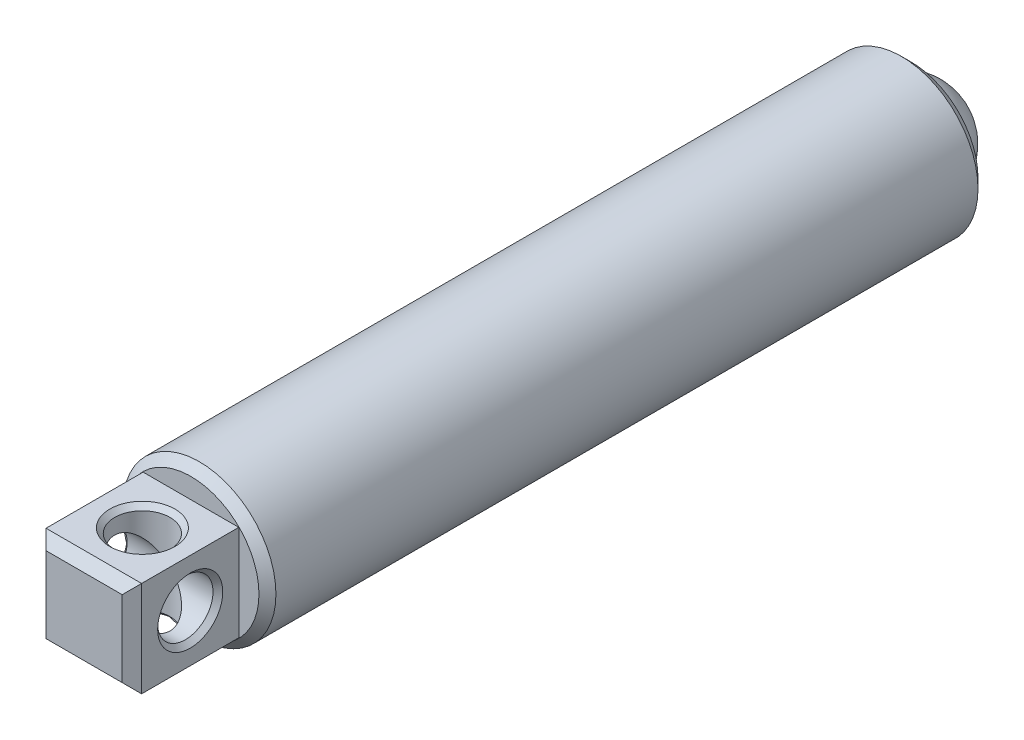
ISO-10303-21;
HEADER;
FILE_DESCRIPTION(('STEP AP214'),'2;1');
FILE_NAME('part.step','',(''),(''),'','','');
FILE_SCHEMA(('AUTOMOTIVE_DESIGN { 1 0 10303 214 1 1 1 1 }'));
ENDSEC;
DATA;
#1=APPLICATION_CONTEXT('core data for automotive mechanical design processes');
#2=APPLICATION_PROTOCOL_DEFINITION('international standard','automotive_design',2000,#1);
#3=PRODUCT_CONTEXT('',#1,'mechanical');
#4=PRODUCT('Part','Part','',(#3));
#5=PRODUCT_RELATED_PRODUCT_CATEGORY('part','',(#4));
#6=PRODUCT_DEFINITION_FORMATION('','',#4);
#7=PRODUCT_DEFINITION_CONTEXT('part definition',#1,'design');
#8=PRODUCT_DEFINITION('design','',#6,#7);
#9=PRODUCT_DEFINITION_SHAPE('','',#8);
#10=(LENGTH_UNIT() NAMED_UNIT(*) SI_UNIT(.MILLI.,.METRE.));
#11=(NAMED_UNIT(*) PLANE_ANGLE_UNIT() SI_UNIT($,.RADIAN.));
#12=(NAMED_UNIT(*) SI_UNIT($,.STERADIAN.) SOLID_ANGLE_UNIT());
#13=UNCERTAINTY_MEASURE_WITH_UNIT(LENGTH_MEASURE(1.E-05),#10,'distance_accuracy_value','');
#14=(GEOMETRIC_REPRESENTATION_CONTEXT(3) GLOBAL_UNCERTAINTY_ASSIGNED_CONTEXT((#13)) GLOBAL_UNIT_ASSIGNED_CONTEXT((#10,
#11,#12)) REPRESENTATION_CONTEXT('',''));
#15=CARTESIAN_POINT('',(0.,0.,0.));
#16=DIRECTION('',(0.,0.,1.));
#17=DIRECTION('',(1.,0.,0.));
#18=AXIS2_PLACEMENT_3D('',#15,#16,#17);
#19=CARTESIAN_POINT('',(1.6625129625254,-2.46036743646982,-11.2258856071015));
#20=DIRECTION('',(0.0471626503272194,0.998887223070809,0.));
#21=DIRECTION('',(-0.998887223070809,0.0471626503272194,0.));
#22=AXIS2_PLACEMENT_3D('',#19,#20,#21);
#23=SPHERICAL_SURFACE('',#22,1.3890625);
#24=CARTESIAN_POINT('',(1.6625129625254,-2.46036743646982,-11.2258856071015));
#25=DIRECTION('',(-0.0471626503272197,-0.998887223070809,0.));
#26=DIRECTION('',(0.,0.,-1.));
#27=AXIS2_PLACEMENT_3D('',#24,#25,#26);
#28=CIRCLE('',#27,1.3890625);
#29=CARTESIAN_POINT('',(0.274996179228602,-2.39485556749967,-11.2258856071015));
#30=VERTEX_POINT('',#29);
#31=CARTESIAN_POINT('',(3.05002974582219,-2.52587930543998,-11.2258856071015));
#32=VERTEX_POINT('',#31);
#33=EDGE_CURVE('P0_E38',#30,#32,#28,.T.);
#34=ORIENTED_EDGE('',*,*,#33,.T.);
#35=CARTESIAN_POINT('',(1.6625129625254,-2.46036743646982,-11.2258856071015));
#36=DIRECTION('',(0.,0.,-1.));
#37=DIRECTION('',(-0.998887223070809,0.0471626503272197,0.));
#38=AXIS2_PLACEMENT_3D('',#35,#36,#37);
#39=CIRCLE('',#38,1.3890625);
#40=EDGE_CURVE('P0_E11',#32,#30,#39,.T.);
#41=ORIENTED_EDGE('',*,*,#40,.T.);
#42=EDGE_LOOP('',(#34,#41));
#43=FACE_BOUND('',#42,.T.);
#44=ADVANCED_FACE('P0_F16',(#43),#23,.T.);
#45=ORIENTED_EDGE('',*,*,#33,.F.);
#46=CARTESIAN_POINT('',(1.6625129625254,-2.46036743646982,-11.2258856071015));
#47=DIRECTION('',(0.,0.,-1.));
#48=DIRECTION('',(-0.998887223070809,0.0471626503272197,0.));
#49=AXIS2_PLACEMENT_3D('',#46,#47,#48);
#50=CIRCLE('',#49,1.3890625);
#51=EDGE_CURVE('P0_E23',#30,#32,#50,.T.);
#52=ORIENTED_EDGE('',*,*,#51,.T.);
#53=EDGE_LOOP('',(#45,#52));
#54=FACE_BOUND('',#53,.T.);
#55=ADVANCED_FACE('P0_F37',(#54),#23,.T.);
#56=ORIENTED_EDGE('',*,*,#40,.F.);
#57=EDGE_CURVE('P0_E34',#32,#30,#28,.T.);
#58=ORIENTED_EDGE('',*,*,#57,.T.);
#59=EDGE_LOOP('',(#56,#58));
#60=FACE_BOUND('',#59,.T.);
#61=ADVANCED_FACE('P0_F32',(#60),#23,.T.);
#62=ORIENTED_EDGE('',*,*,#51,.F.);
#63=ORIENTED_EDGE('',*,*,#57,.F.);
#64=EDGE_LOOP('',(#62,#63));
#65=FACE_BOUND('',#64,.T.);
#66=ADVANCED_FACE('P0_F18',(#65),#23,.T.);
#67=CLOSED_SHELL('',(#44,#55,#61,#66));
#68=MANIFOLD_SOLID_BREP('P0_B1',#67);
#69=CARTESIAN_POINT('',(-0.337483037474602,-2.46036743646982,8.6550518928985));
#70=DIRECTION('',(1.,0.,0.));
#71=DIRECTION('',(0.,0.,-1.));
#72=AXIS2_PLACEMENT_3D('',#69,#70,#71);
#73=CYLINDRICAL_SURFACE('',#72,0.7239);
#74=CARTESIAN_POINT('',(2.78551296252539,-2.46036743646982,8.6550518928985));
#75=DIRECTION('',(-1.,0.,0.));
#76=DIRECTION('',(0.,0.,1.));
#77=AXIS2_PLACEMENT_3D('',#74,#75,#76);
#78=CIRCLE('',#77,0.7239);
#79=CARTESIAN_POINT('',(2.78551296252539,-2.46036743646982,9.3789518928985));
#80=VERTEX_POINT('',#79);
#81=EDGE_CURVE('P1_E119',#80,#80,#78,.F.);
#82=ORIENTED_EDGE('',*,*,#81,.T.);
#83=EDGE_LOOP('',(#82));
#84=FACE_BOUND('',#83,.T.);
#85=CARTESIAN_POINT('',(1.6625129625254,-2.46036743646982,8.6550518928985));
#86=DIRECTION('',(0.707106781186547,-0.707106781186547,0.));
#87=DIRECTION('',(0.707106781186547,0.707106781186547,0.));
#88=AXIS2_PLACEMENT_3D('',#85,#86,#87);
#89=ELLIPSE('',#88,1.02374919780188,0.7239);
#90=CARTESIAN_POINT('',(1.6625129625254,-2.46036743646982,9.3789518928985));
#91=VERTEX_POINT('',#90);
#92=CARTESIAN_POINT('',(1.6625129625254,-2.46036743646982,7.9311518928985));
#93=VERTEX_POINT('',#92);
#94=EDGE_CURVE('P1_E86',#91,#93,#89,.F.);
#95=ORIENTED_EDGE('',*,*,#94,.T.);
#96=CARTESIAN_POINT('',(1.6625129625254,-2.46036743646982,8.6550518928985));
#97=DIRECTION('',(0.707106781186547,0.707106781186547,0.));
#98=DIRECTION('',(0.707106781186547,-0.707106781186547,0.));
#99=AXIS2_PLACEMENT_3D('',#96,#97,#98);
#100=ELLIPSE('',#99,1.02374919780188,0.7239);
#101=EDGE_CURVE('P1_E82',#93,#91,#100,.F.);
#102=ORIENTED_EDGE('',*,*,#101,.T.);
#103=EDGE_LOOP('',(#95,#102));
#104=FACE_BOUND('',#103,.T.);
#105=ADVANCED_FACE('P1_F15',(#84,#104),#73,.F.);
#106=CARTESIAN_POINT('',(1.6625129625254,-0.682367436469824,7.3850518928985));
#107=DIRECTION('',(0.,0.,-1.));
#108=DIRECTION('',(-1.,0.,0.));
#109=AXIS2_PLACEMENT_3D('',#106,#107,#108);
#110=PLANE('',#109);
#111=CARTESIAN_POINT('',(1.6625129625254,-2.46036743646982,7.3850518928985));
#112=DIRECTION('',(0.,0.,1.));
#113=DIRECTION('',(1.,0.,0.));
#114=AXIS2_PLACEMENT_3D('',#111,#112,#113);
#115=CIRCLE('',#114,1.778);
#116=CARTESIAN_POINT('',(3.4405129625254,-2.46036743646982,7.3850518928985));
#117=VERTEX_POINT('',#116);
#118=EDGE_CURVE('P1_E178',#117,#117,#115,.T.);
#119=ORIENTED_EDGE('',*,*,#118,.T.);
#120=EDGE_LOOP('',(#119));
#121=FACE_BOUND('',#120,.T.);
#122=DIRECTION('',(0.,1.,0.));
#123=VECTOR('',#122,1.);
#124=CARTESIAN_POINT('',(2.9125129625254,-3.71036743646982,7.3850518928985));
#125=LINE('',#124,#123);
#126=CARTESIAN_POINT('',(2.9125129625254,-3.71036743646982,7.3850518928985));
#127=VERTEX_POINT('',#126);
#128=CARTESIAN_POINT('',(2.9125129625254,-1.21036743646982,7.3850518928985));
#129=VERTEX_POINT('',#128);
#130=EDGE_CURVE('P1_E152',#127,#129,#125,.T.);
#131=ORIENTED_EDGE('',*,*,#130,.F.);
#132=DIRECTION('',(1.,0.,0.));
#133=VECTOR('',#132,1.);
#134=CARTESIAN_POINT('',(0.412512962525397,-3.71036743646982,7.3850518928985));
#135=LINE('',#134,#133);
#136=CARTESIAN_POINT('',(0.412512962525397,-3.71036743646982,7.3850518928985));
#137=VERTEX_POINT('',#136);
#138=EDGE_CURVE('P1_E167',#137,#127,#135,.T.);
#139=ORIENTED_EDGE('',*,*,#138,.F.);
#140=DIRECTION('',(0.,-1.,0.));
#141=VECTOR('',#140,1.);
#142=CARTESIAN_POINT('',(0.412512962525397,-3.71036743646982,7.3850518928985));
#143=LINE('',#142,#141);
#144=CARTESIAN_POINT('',(0.412512962525397,-1.21036743646982,7.3850518928985));
#145=VERTEX_POINT('',#144);
#146=EDGE_CURVE('P1_E162',#145,#137,#143,.T.);
#147=ORIENTED_EDGE('',*,*,#146,.F.);
#148=DIRECTION('',(-1.,0.,0.));
#149=VECTOR('',#148,1.);
#150=CARTESIAN_POINT('',(0.412512962525397,-1.21036743646982,7.3850518928985));
#151=LINE('',#150,#149);
#152=EDGE_CURVE('P1_E157',#129,#145,#151,.T.);
#153=ORIENTED_EDGE('',*,*,#152,.F.);
#154=EDGE_LOOP('',(#131,#139,#147,#153));
#155=FACE_BOUND('',#154,.T.);
#156=ADVANCED_FACE('P1_F195',(#121,#155),#110,.F.);
#157=CARTESIAN_POINT('',(1.6625129625254,-2.46036743646982,-9.26145458061761));
#158=DIRECTION('',(0.,0.,-1.));
#159=DIRECTION('',(-1.,0.,0.));
#160=AXIS2_PLACEMENT_3D('',#157,#158,#159);
#161=CONICAL_SURFACE('',#160,0.,0.785398163397443);
#162=CARTESIAN_POINT('',(1.6625129625254,-2.46036743646982,-10.6584545806176));
#163=DIRECTION('',(0.,0.,1.));
#164=DIRECTION('',(1.,0.,0.));
#165=AXIS2_PLACEMENT_3D('',#162,#163,#164);
#166=CIRCLE('',#165,1.397);
#167=CARTESIAN_POINT('',(3.0595129625254,-2.46036743646982,-10.6584545806176));
#168=VERTEX_POINT('',#167);
#169=EDGE_CURVE('P1_E92',#168,#168,#166,.T.);
#170=ORIENTED_EDGE('',*,*,#169,.F.);
#171=EDGE_LOOP('',(#170));
#172=FACE_BOUND('',#171,.T.);
#173=CARTESIAN_POINT('',(1.6625129625254,-2.46036743646982,-9.26145458061761));
#174=VERTEX_POINT('',#173);
#175=VERTEX_LOOP('',#174);
#176=FACE_BOUND('',#175,.T.);
#177=ADVANCED_FACE('P1_F192',(#172,#176),#161,.F.);
#178=CARTESIAN_POINT('',(1.6625129625254,-2.46036743646982,7.3850518928985));
#179=DIRECTION('',(0.,0.,1.));
#180=DIRECTION('',(1.,0.,0.));
#181=AXIS2_PLACEMENT_3D('',#178,#179,#180);
#182=CYLINDRICAL_SURFACE('',#181,1.397);
#183=CARTESIAN_POINT('',(1.6625129625254,-2.46036743646982,-11.4465481071015));
#184=DIRECTION('',(0.,0.,1.));
#185=DIRECTION('',(1.,0.,0.));
#186=AXIS2_PLACEMENT_3D('',#183,#184,#185);
#187=CIRCLE('',#186,1.397);
#188=CARTESIAN_POINT('',(3.0595129625254,-2.46036743646982,-11.4465481071015));
#189=VERTEX_POINT('',#188);
#190=EDGE_CURVE('P1_E184',#189,#189,#187,.T.);
#191=ORIENTED_EDGE('',*,*,#190,.F.);
#192=EDGE_LOOP('',(#191));
#193=FACE_BOUND('',#192,.T.);
#194=ORIENTED_EDGE('',*,*,#169,.T.);
#195=EDGE_LOOP('',(#194));
#196=FACE_BOUND('',#195,.T.);
#197=ADVANCED_FACE('P1_F190',(#193,#196),#182,.F.);
#198=CARTESIAN_POINT('',(1.6625129625254,-0.460371436469824,-11.4465481071015));
#199=DIRECTION('',(0.,0.,1.));
#200=DIRECTION('',(1.,0.,0.));
#201=AXIS2_PLACEMENT_3D('',#198,#199,#200);
#202=PLANE('',#201);
#203=CARTESIAN_POINT('',(1.6625129625254,-2.46036743646982,-11.4465481071015));
#204=DIRECTION('',(0.,0.,1.));
#205=DIRECTION('',(1.,0.,0.));
#206=AXIS2_PLACEMENT_3D('',#203,#204,#205);
#207=CIRCLE('',#206,1.745996);
#208=CARTESIAN_POINT('',(3.4085089625254,-2.46036743646982,-11.4465481071015));
#209=VERTEX_POINT('',#208);
#210=EDGE_CURVE('P1_E101',#209,#209,#207,.F.);
#211=ORIENTED_EDGE('',*,*,#210,.T.);
#212=EDGE_LOOP('',(#211));
#213=FACE_BOUND('',#212,.T.);
#214=ORIENTED_EDGE('',*,*,#190,.T.);
#215=EDGE_LOOP('',(#214));
#216=FACE_BOUND('',#215,.T.);
#217=ADVANCED_FACE('P1_F202',(#213,#216),#202,.F.);
#218=CARTESIAN_POINT('',(1.6625129625254,-2.46036743646982,7.3850518928985));
#219=DIRECTION('',(0.,0.,1.));
#220=DIRECTION('',(1.,0.,0.));
#221=AXIS2_PLACEMENT_3D('',#218,#219,#220);
#222=CYLINDRICAL_SURFACE('',#221,1.999996);
#223=CARTESIAN_POINT('',(1.6625129625254,-2.46036743646982,-11.1925481071015));
#224=DIRECTION('',(0.,0.,1.));
#225=DIRECTION('',(1.,0.,0.));
#226=AXIS2_PLACEMENT_3D('',#223,#224,#225);
#227=CIRCLE('',#226,1.999996);
#228=CARTESIAN_POINT('',(3.6625089625254,-2.46036743646982,-11.1925481071015));
#229=VERTEX_POINT('',#228);
#230=EDGE_CURVE('P1_E94',#229,#229,#227,.T.);
#231=ORIENTED_EDGE('',*,*,#230,.T.);
#232=EDGE_LOOP('',(#231));
#233=FACE_BOUND('',#232,.T.);
#234=CARTESIAN_POINT('',(1.6625129625254,-2.46036743646982,7.1630558928985));
#235=DIRECTION('',(0.,0.,1.));
#236=DIRECTION('',(1.,0.,0.));
#237=AXIS2_PLACEMENT_3D('',#234,#235,#236);
#238=CIRCLE('',#237,1.999996);
#239=CARTESIAN_POINT('',(3.6625089625254,-2.46036743646982,7.1630558928985));
#240=VERTEX_POINT('',#239);
#241=EDGE_CURVE('P1_E181',#240,#240,#238,.T.);
#242=ORIENTED_EDGE('',*,*,#241,.F.);
#243=EDGE_LOOP('',(#242));
#244=FACE_BOUND('',#243,.T.);
#245=ADVANCED_FACE('P1_F285',(#233,#244),#222,.T.);
#246=CARTESIAN_POINT('',(1.6625129625254,-2.46036743646982,7.1630558928985));
#247=DIRECTION('',(0.,0.,-1.));
#248=DIRECTION('',(-1.,0.,0.));
#249=AXIS2_PLACEMENT_3D('',#246,#247,#248);
#250=CONICAL_SURFACE('',#249,1.999996,0.78539816339745);
#251=ORIENTED_EDGE('',*,*,#118,.F.);
#252=EDGE_LOOP('',(#251));
#253=FACE_BOUND('',#252,.T.);
#254=ORIENTED_EDGE('',*,*,#241,.T.);
#255=EDGE_LOOP('',(#254));
#256=FACE_BOUND('',#255,.T.);
#257=ADVANCED_FACE('P1_F288',(#253,#256),#250,.T.);
#258=CARTESIAN_POINT('',(2.9125129625254,-3.71036743646982,10.1790518928985));
#259=DIRECTION('',(-1.,0.,0.));
#260=DIRECTION('',(0.,0.,1.));
#261=AXIS2_PLACEMENT_3D('',#258,#259,#260);
#262=PLANE('',#261);
#263=CARTESIAN_POINT('',(2.9125129625254,-2.46036743646982,8.6550518928985));
#264=DIRECTION('',(-1.,0.,0.));
#265=DIRECTION('',(0.,0.,1.));
#266=AXIS2_PLACEMENT_3D('',#263,#264,#265);
#267=CIRCLE('',#266,0.850900000000005);
#268=CARTESIAN_POINT('',(2.9125129625254,-2.46036743646982,9.5059518928985));
#269=VERTEX_POINT('',#268);
#270=EDGE_CURVE('P1_E116',#269,#269,#267,.T.);
#271=ORIENTED_EDGE('',*,*,#270,.T.);
#272=EDGE_LOOP('',(#271));
#273=FACE_BOUND('',#272,.T.);
#274=DIRECTION('',(0.,0.,-1.));
#275=VECTOR('',#274,1.);
#276=CARTESIAN_POINT('',(2.9125129625254,-1.21036743646982,10.1790518928985));
#277=LINE('',#276,#275);
#278=CARTESIAN_POINT('',(2.9125129625254,-1.21036743646982,9.9250518928985));
#279=VERTEX_POINT('',#278);
#280=EDGE_CURVE('P1_E176',#279,#129,#277,.T.);
#281=ORIENTED_EDGE('',*,*,#280,.F.);
#282=DIRECTION('',(0.,-1.,0.));
#283=VECTOR('',#282,1.);
#284=CARTESIAN_POINT('',(2.9125129625254,-3.71036743646982,9.9250518928985));
#285=LINE('',#284,#283);
#286=CARTESIAN_POINT('',(2.9125129625254,-3.71036743646982,9.9250518928985));
#287=VERTEX_POINT('',#286);
#288=EDGE_CURVE('P1_E10',#279,#287,#285,.T.);
#289=ORIENTED_EDGE('',*,*,#288,.T.);
#290=DIRECTION('',(0.,0.,-1.));
#291=VECTOR('',#290,1.);
#292=CARTESIAN_POINT('',(2.9125129625254,-3.71036743646982,10.1790518928985));
#293=LINE('',#292,#291);
#294=EDGE_CURVE('P1_E170',#287,#127,#293,.T.);
#295=ORIENTED_EDGE('',*,*,#294,.T.);
#296=ORIENTED_EDGE('',*,*,#130,.T.);
#297=EDGE_LOOP('',(#281,#289,#295,#296));
#298=FACE_BOUND('',#297,.T.);
#299=ADVANCED_FACE('P1_F245',(#273,#298),#262,.F.);
#300=CARTESIAN_POINT('',(0.412512962525397,-1.21036743646982,10.1790518928985));
#301=DIRECTION('',(0.,-1.,0.));
#302=DIRECTION('',(0.,0.,-1.));
#303=AXIS2_PLACEMENT_3D('',#300,#301,#302);
#304=PLANE('',#303);
#305=CARTESIAN_POINT('',(1.6625129625254,-1.21036743646982,8.6550518928985));
#306=DIRECTION('',(0.,-1.,0.));
#307=DIRECTION('',(0.,0.,-1.));
#308=AXIS2_PLACEMENT_3D('',#305,#306,#307);
#309=CIRCLE('',#308,0.850900000000005);
#310=CARTESIAN_POINT('',(1.6625129625254,-1.21036743646982,7.8041518928985));
#311=VERTEX_POINT('',#310);
#312=EDGE_CURVE('P1_E122',#311,#311,#309,.T.);
#313=ORIENTED_EDGE('',*,*,#312,.T.);
#314=EDGE_LOOP('',(#313));
#315=FACE_BOUND('',#314,.T.);
#316=DIRECTION('',(0.,0.,-1.));
#317=VECTOR('',#316,1.);
#318=CARTESIAN_POINT('',(0.412512962525397,-1.21036743646982,10.1790518928985));
#319=LINE('',#318,#317);
#320=CARTESIAN_POINT('',(0.412512962525397,-1.21036743646982,9.9250518928985));
#321=VERTEX_POINT('',#320);
#322=EDGE_CURVE('P1_E174',#321,#145,#319,.T.);
#323=ORIENTED_EDGE('',*,*,#322,.F.);
#324=DIRECTION('',(1.,0.,0.));
#325=VECTOR('',#324,1.);
#326=CARTESIAN_POINT('',(0.412512962525397,-1.21036743646982,9.9250518928985));
#327=LINE('',#326,#325);
#328=EDGE_CURVE('P1_E24',#321,#279,#327,.T.);
#329=ORIENTED_EDGE('',*,*,#328,.T.);
#330=ORIENTED_EDGE('',*,*,#280,.T.);
#331=ORIENTED_EDGE('',*,*,#152,.T.);
#332=EDGE_LOOP('',(#323,#329,#330,#331));
#333=FACE_BOUND('',#332,.T.);
#334=ADVANCED_FACE('P1_F236',(#315,#333),#304,.F.);
#335=CARTESIAN_POINT('',(0.412512962525397,-3.71036743646982,10.1790518928985));
#336=DIRECTION('',(1.,0.,0.));
#337=DIRECTION('',(0.,0.,-1.));
#338=AXIS2_PLACEMENT_3D('',#335,#336,#337);
#339=PLANE('',#338);
#340=CARTESIAN_POINT('',(0.412512962525397,-2.46036743646982,8.6550518928985));
#341=DIRECTION('',(1.,0.,0.));
#342=DIRECTION('',(0.,0.,-1.));
#343=AXIS2_PLACEMENT_3D('',#340,#341,#342);
#344=CIRCLE('',#343,0.8509);
#345=CARTESIAN_POINT('',(0.412512962525397,-2.46036743646982,7.8041518928985));
#346=VERTEX_POINT('',#345);
#347=EDGE_CURVE('P1_E104',#346,#346,#344,.T.);
#348=ORIENTED_EDGE('',*,*,#347,.T.);
#349=EDGE_LOOP('',(#348));
#350=FACE_BOUND('',#349,.T.);
#351=DIRECTION('',(0.,0.,-1.));
#352=VECTOR('',#351,1.);
#353=CARTESIAN_POINT('',(0.412512962525397,-3.71036743646982,10.1790518928985));
#354=LINE('',#353,#352);
#355=CARTESIAN_POINT('',(0.412512962525397,-3.71036743646982,9.9250518928985));
#356=VERTEX_POINT('',#355);
#357=EDGE_CURVE('P1_E172',#356,#137,#354,.T.);
#358=ORIENTED_EDGE('',*,*,#357,.F.);
#359=DIRECTION('',(0.,1.,0.));
#360=VECTOR('',#359,1.);
#361=CARTESIAN_POINT('',(0.412512962525397,-3.71036743646982,9.9250518928985));
#362=LINE('',#361,#360);
#363=EDGE_CURVE('P1_E39',#356,#321,#362,.T.);
#364=ORIENTED_EDGE('',*,*,#363,.T.);
#365=ORIENTED_EDGE('',*,*,#322,.T.);
#366=ORIENTED_EDGE('',*,*,#146,.T.);
#367=EDGE_LOOP('',(#358,#364,#365,#366));
#368=FACE_BOUND('',#367,.T.);
#369=ADVANCED_FACE('P1_F234',(#350,#368),#339,.F.);
#370=CARTESIAN_POINT('',(0.412512962525397,-3.71036743646982,10.1790518928985));
#371=DIRECTION('',(0.,1.,0.));
#372=DIRECTION('',(0.,0.,1.));
#373=AXIS2_PLACEMENT_3D('',#370,#371,#372);
#374=PLANE('',#373);
#375=CARTESIAN_POINT('',(1.6625129625254,-3.71036743646982,8.6550518928985));
#376=DIRECTION('',(0.,1.,0.));
#377=DIRECTION('',(0.,0.,1.));
#378=AXIS2_PLACEMENT_3D('',#375,#376,#377);
#379=CIRCLE('',#378,0.8509);
#380=CARTESIAN_POINT('',(1.6625129625254,-3.71036743646982,9.5059518928985));
#381=VERTEX_POINT('',#380);
#382=EDGE_CURVE('P1_E110',#381,#381,#379,.T.);
#383=ORIENTED_EDGE('',*,*,#382,.T.);
#384=EDGE_LOOP('',(#383));
#385=FACE_BOUND('',#384,.T.);
#386=ORIENTED_EDGE('',*,*,#294,.F.);
#387=DIRECTION('',(-1.,0.,0.));
#388=VECTOR('',#387,1.);
#389=CARTESIAN_POINT('',(0.412512962525397,-3.71036743646982,9.9250518928985));
#390=LINE('',#389,#388);
#391=EDGE_CURVE('P1_E137',#287,#356,#390,.T.);
#392=ORIENTED_EDGE('',*,*,#391,.T.);
#393=ORIENTED_EDGE('',*,*,#357,.T.);
#394=ORIENTED_EDGE('',*,*,#138,.T.);
#395=EDGE_LOOP('',(#386,#392,#393,#394));
#396=FACE_BOUND('',#395,.T.);
#397=ADVANCED_FACE('P1_F222',(#385,#396),#374,.F.);
#398=CARTESIAN_POINT('',(1.6625129625254,-2.46036743646982,10.1790518928985));
#399=DIRECTION('',(0.,0.,-1.));
#400=DIRECTION('',(-1.,0.,0.));
#401=AXIS2_PLACEMENT_3D('',#398,#399,#400);
#402=PLANE('',#401);
#403=DIRECTION('',(0.,-1.,0.));
#404=VECTOR('',#403,1.);
#405=CARTESIAN_POINT('',(0.666512962525401,-2.46036743646982,10.1790518928985));
#406=LINE('',#405,#404);
#407=CARTESIAN_POINT('',(0.666512962525401,-1.46436743646983,10.1790518928985));
#408=VERTEX_POINT('',#407);
#409=CARTESIAN_POINT('',(0.666512962525401,-3.45636743646982,10.1790518928985));
#410=VERTEX_POINT('',#409);
#411=EDGE_CURVE('P1_E132',#408,#410,#406,.T.);
#412=ORIENTED_EDGE('',*,*,#411,.T.);
#413=DIRECTION('',(1.,0.,0.));
#414=VECTOR('',#413,1.);
#415=CARTESIAN_POINT('',(1.6625129625254,-3.45636743646982,10.1790518928985));
#416=LINE('',#415,#414);
#417=CARTESIAN_POINT('',(2.65851296252539,-3.45636743646982,10.1790518928985));
#418=VERTEX_POINT('',#417);
#419=EDGE_CURVE('P1_E134',#410,#418,#416,.T.);
#420=ORIENTED_EDGE('',*,*,#419,.T.);
#421=DIRECTION('',(0.,1.,0.));
#422=VECTOR('',#421,1.);
#423=CARTESIAN_POINT('',(2.65851296252539,-2.46036743646982,10.1790518928985));
#424=LINE('',#423,#422);
#425=CARTESIAN_POINT('',(2.65851296252539,-1.46436743646983,10.1790518928985));
#426=VERTEX_POINT('',#425);
#427=EDGE_CURVE('P1_E128',#418,#426,#424,.T.);
#428=ORIENTED_EDGE('',*,*,#427,.T.);
#429=DIRECTION('',(-1.,0.,0.));
#430=VECTOR('',#429,1.);
#431=CARTESIAN_POINT('',(1.6625129625254,-1.46436743646983,10.1790518928985));
#432=LINE('',#431,#430);
#433=EDGE_CURVE('P1_E130',#426,#408,#432,.T.);
#434=ORIENTED_EDGE('',*,*,#433,.T.);
#435=EDGE_LOOP('',(#412,#420,#428,#434));
#436=FACE_BOUND('',#435,.T.);
#437=ADVANCED_FACE('P1_F215',(#436),#402,.F.);
#438=CARTESIAN_POINT('',(0.539512962525398,-2.46036743646982,8.6550518928985));
#439=DIRECTION('',(1.,0.,0.));
#440=DIRECTION('',(0.,0.,-1.));
#441=AXIS2_PLACEMENT_3D('',#438,#439,#440);
#442=CIRCLE('',#441,0.7239);
#443=CARTESIAN_POINT('',(0.539512962525398,-2.46036743646982,7.9311518928985));
#444=VERTEX_POINT('',#443);
#445=EDGE_CURVE('P1_E107',#444,#444,#442,.F.);
#446=ORIENTED_EDGE('',*,*,#445,.T.);
#447=EDGE_LOOP('',(#446));
#448=FACE_BOUND('',#447,.T.);
#449=CARTESIAN_POINT('',(1.6625129625254,-2.46036743646982,8.6550518928985));
#450=DIRECTION('',(0.707106781186547,-0.707106781186547,0.));
#451=DIRECTION('',(0.707106781186547,0.707106781186547,0.));
#452=AXIS2_PLACEMENT_3D('',#449,#450,#451);
#453=ELLIPSE('',#452,1.02374919780188,0.7239);
#454=EDGE_CURVE('P1_E78',#91,#93,#453,.T.);
#455=ORIENTED_EDGE('',*,*,#454,.T.);
#456=CARTESIAN_POINT('',(1.6625129625254,-2.46036743646982,8.6550518928985));
#457=DIRECTION('',(0.707106781186547,0.707106781186547,0.));
#458=DIRECTION('',(0.707106781186547,-0.707106781186547,0.));
#459=AXIS2_PLACEMENT_3D('',#456,#457,#458);
#460=ELLIPSE('',#459,1.02374919780188,0.7239);
#461=EDGE_CURVE('P1_E85',#93,#91,#460,.T.);
#462=ORIENTED_EDGE('',*,*,#461,.T.);
#463=EDGE_LOOP('',(#455,#462));
#464=FACE_BOUND('',#463,.T.);
#465=ADVANCED_FACE('P1_F96',(#448,#464),#73,.F.);
#466=CARTESIAN_POINT('',(1.6625129625254,-4.46036343646982,8.6550518928985));
#467=DIRECTION('',(0.,1.,0.));
#468=DIRECTION('',(0.,0.,1.));
#469=AXIS2_PLACEMENT_3D('',#466,#467,#468);
#470=CYLINDRICAL_SURFACE('',#469,0.7239);
#471=CARTESIAN_POINT('',(1.6625129625254,-1.33736743646983,8.6550518928985));
#472=DIRECTION('',(0.,-1.,0.));
#473=DIRECTION('',(0.,0.,-1.));
#474=AXIS2_PLACEMENT_3D('',#471,#472,#473);
#475=CIRCLE('',#474,0.7239);
#476=CARTESIAN_POINT('',(1.6625129625254,-1.33736743646983,7.9311518928985));
#477=VERTEX_POINT('',#476);
#478=EDGE_CURVE('P1_E125',#477,#477,#475,.F.);
#479=ORIENTED_EDGE('',*,*,#478,.T.);
#480=EDGE_LOOP('',(#479));
#481=FACE_BOUND('',#480,.T.);
#482=ORIENTED_EDGE('',*,*,#94,.F.);
#483=ORIENTED_EDGE('',*,*,#461,.F.);
#484=EDGE_LOOP('',(#482,#483));
#485=FACE_BOUND('',#484,.T.);
#486=ADVANCED_FACE('P1_F90',(#481,#485),#470,.F.);
#487=CARTESIAN_POINT('',(1.6625129625254,-3.58336743646982,8.6550518928985));
#488=DIRECTION('',(0.,1.,0.));
#489=DIRECTION('',(0.,0.,1.));
#490=AXIS2_PLACEMENT_3D('',#487,#488,#489);
#491=CIRCLE('',#490,0.7239);
#492=CARTESIAN_POINT('',(1.6625129625254,-3.58336743646982,9.3789518928985));
#493=VERTEX_POINT('',#492);
#494=EDGE_CURVE('P1_E113',#493,#493,#491,.F.);
#495=ORIENTED_EDGE('',*,*,#494,.T.);
#496=EDGE_LOOP('',(#495));
#497=FACE_BOUND('',#496,.T.);
#498=ORIENTED_EDGE('',*,*,#454,.F.);
#499=ORIENTED_EDGE('',*,*,#101,.F.);
#500=EDGE_LOOP('',(#498,#499));
#501=FACE_BOUND('',#500,.T.);
#502=ADVANCED_FACE('P1_F80',(#497,#501),#470,.F.);
#503=CARTESIAN_POINT('',(1.6625129625254,-2.46036743646982,-11.1925481071015));
#504=DIRECTION('',(0.,0.,1.));
#505=DIRECTION('',(1.,0.,0.));
#506=AXIS2_PLACEMENT_3D('',#503,#504,#505);
#507=CONICAL_SURFACE('',#506,1.999996,0.785398163397451);
#508=ORIENTED_EDGE('',*,*,#210,.F.);
#509=EDGE_LOOP('',(#508));
#510=FACE_BOUND('',#509,.T.);
#511=ORIENTED_EDGE('',*,*,#230,.F.);
#512=EDGE_LOOP('',(#511));
#513=FACE_BOUND('',#512,.T.);
#514=ADVANCED_FACE('P1_F230',(#510,#513),#507,.T.);
#515=CARTESIAN_POINT('',(0.412512962525397,-2.46036743646982,8.6550518928985));
#516=DIRECTION('',(-1.,0.,0.));
#517=DIRECTION('',(0.,0.,1.));
#518=AXIS2_PLACEMENT_3D('',#515,#516,#517);
#519=CONICAL_SURFACE('',#518,0.8509,0.785398163397444);
#520=ORIENTED_EDGE('',*,*,#445,.F.);
#521=EDGE_LOOP('',(#520));
#522=FACE_BOUND('',#521,.T.);
#523=ORIENTED_EDGE('',*,*,#347,.F.);
#524=EDGE_LOOP('',(#523));
#525=FACE_BOUND('',#524,.T.);
#526=ADVANCED_FACE('P1_F226',(#522,#525),#519,.F.);
#527=CARTESIAN_POINT('',(1.6625129625254,-3.71036743646982,8.6550518928985));
#528=DIRECTION('',(0.,-1.,0.));
#529=DIRECTION('',(0.,0.,-1.));
#530=AXIS2_PLACEMENT_3D('',#527,#528,#529);
#531=CONICAL_SURFACE('',#530,0.8509,0.785398163397445);
#532=ORIENTED_EDGE('',*,*,#494,.F.);
#533=EDGE_LOOP('',(#532));
#534=FACE_BOUND('',#533,.T.);
#535=ORIENTED_EDGE('',*,*,#382,.F.);
#536=EDGE_LOOP('',(#535));
#537=FACE_BOUND('',#536,.T.);
#538=ADVANCED_FACE('P1_F229',(#534,#537),#531,.F.);
#539=CARTESIAN_POINT('',(2.9125129625254,-2.46036743646982,8.6550518928985));
#540=DIRECTION('',(1.,0.,0.));
#541=DIRECTION('',(0.,0.,-1.));
#542=AXIS2_PLACEMENT_3D('',#539,#540,#541);
#543=CONICAL_SURFACE('',#542,0.850900000000005,0.785398163397444);
#544=ORIENTED_EDGE('',*,*,#81,.F.);
#545=EDGE_LOOP('',(#544));
#546=FACE_BOUND('',#545,.T.);
#547=ORIENTED_EDGE('',*,*,#270,.F.);
#548=EDGE_LOOP('',(#547));
#549=FACE_BOUND('',#548,.T.);
#550=ADVANCED_FACE('P1_F267',(#546,#549),#543,.F.);
#551=CARTESIAN_POINT('',(1.6625129625254,-1.21036743646982,8.6550518928985));
#552=DIRECTION('',(0.,1.,0.));
#553=DIRECTION('',(0.,0.,1.));
#554=AXIS2_PLACEMENT_3D('',#551,#552,#553);
#555=CONICAL_SURFACE('',#554,0.850900000000005,0.785398163397445);
#556=ORIENTED_EDGE('',*,*,#478,.F.);
#557=EDGE_LOOP('',(#556));
#558=FACE_BOUND('',#557,.T.);
#559=ORIENTED_EDGE('',*,*,#312,.F.);
#560=EDGE_LOOP('',(#559));
#561=FACE_BOUND('',#560,.T.);
#562=ADVANCED_FACE('P1_F261',(#558,#561),#555,.F.);
#563=CARTESIAN_POINT('',(1.6625129625254,-1.46436743646983,10.1790518928985));
#564=DIRECTION('',(0.,-0.707106781186547,-0.707106781186547));
#565=DIRECTION('',(-1.,0.,0.));
#566=AXIS2_PLACEMENT_3D('',#563,#564,#565);
#567=PLANE('',#566);
#568=DIRECTION('',(-0.577350269189626,-0.577350269189626,0.577350269189626));
#569=VECTOR('',#568,1.);
#570=CARTESIAN_POINT('',(2.32651296252539,-1.79636743646983,10.5110518928985));
#571=LINE('',#570,#569);
#572=EDGE_CURVE('P1_E145',#279,#426,#571,.T.);
#573=ORIENTED_EDGE('',*,*,#572,.F.);
#574=ORIENTED_EDGE('',*,*,#328,.F.);
#575=DIRECTION('',(0.577350269189626,-0.577350269189626,0.577350269189626));
#576=VECTOR('',#575,1.);
#577=CARTESIAN_POINT('',(0.9985129625254,-1.79636743646983,10.5110518928985));
#578=LINE('',#577,#576);
#579=EDGE_CURVE('P1_E19',#408,#321,#578,.F.);
#580=ORIENTED_EDGE('',*,*,#579,.F.);
#581=ORIENTED_EDGE('',*,*,#433,.F.);
#582=EDGE_LOOP('',(#573,#574,#580,#581));
#583=FACE_BOUND('',#582,.T.);
#584=ADVANCED_FACE('P1_F17',(#583),#567,.F.);
#585=CARTESIAN_POINT('',(0.666512962525401,-2.46036743646982,10.1790518928985));
#586=DIRECTION('',(0.707106781186547,0.,-0.707106781186547));
#587=DIRECTION('',(0.,-1.,0.));
#588=AXIS2_PLACEMENT_3D('',#585,#586,#587);
#589=PLANE('',#588);
#590=ORIENTED_EDGE('',*,*,#579,.T.);
#591=ORIENTED_EDGE('',*,*,#363,.F.);
#592=DIRECTION('',(0.577350269189626,0.577350269189626,0.577350269189626));
#593=VECTOR('',#592,1.);
#594=CARTESIAN_POINT('',(0.9985129625254,-3.12436743646982,10.5110518928985));
#595=LINE('',#594,#593);
#596=EDGE_CURVE('P1_E144',#410,#356,#595,.F.);
#597=ORIENTED_EDGE('',*,*,#596,.F.);
#598=ORIENTED_EDGE('',*,*,#411,.F.);
#599=EDGE_LOOP('',(#590,#591,#597,#598));
#600=FACE_BOUND('',#599,.T.);
#601=ADVANCED_FACE('P1_F254',(#600),#589,.F.);
#602=CARTESIAN_POINT('',(2.65851296252539,-2.46036743646982,10.1790518928985));
#603=DIRECTION('',(-0.707106781186547,0.,-0.707106781186547));
#604=DIRECTION('',(0.,1.,0.));
#605=AXIS2_PLACEMENT_3D('',#602,#603,#604);
#606=PLANE('',#605);
#607=ORIENTED_EDGE('',*,*,#572,.T.);
#608=ORIENTED_EDGE('',*,*,#427,.F.);
#609=DIRECTION('',(0.577350269189626,-0.577350269189626,-0.577350269189626));
#610=VECTOR('',#609,1.);
#611=CARTESIAN_POINT('',(2.32651296252539,-3.12436743646982,10.5110518928985));
#612=LINE('',#611,#610);
#613=EDGE_CURVE('P1_E142',#287,#418,#612,.F.);
#614=ORIENTED_EDGE('',*,*,#613,.F.);
#615=ORIENTED_EDGE('',*,*,#288,.F.);
#616=EDGE_LOOP('',(#607,#608,#614,#615));
#617=FACE_BOUND('',#616,.T.);
#618=ADVANCED_FACE('P1_F249',(#617),#606,.F.);
#619=CARTESIAN_POINT('',(1.6625129625254,-3.45636743646982,10.1790518928985));
#620=DIRECTION('',(0.,0.707106781186547,-0.707106781186547));
#621=DIRECTION('',(1.,0.,0.));
#622=AXIS2_PLACEMENT_3D('',#619,#620,#621);
#623=PLANE('',#622);
#624=ORIENTED_EDGE('',*,*,#596,.T.);
#625=ORIENTED_EDGE('',*,*,#391,.F.);
#626=ORIENTED_EDGE('',*,*,#613,.T.);
#627=ORIENTED_EDGE('',*,*,#419,.F.);
#628=EDGE_LOOP('',(#624,#625,#626,#627));
#629=FACE_BOUND('',#628,.T.);
#630=ADVANCED_FACE('P1_F252',(#629),#623,.F.);
#631=CLOSED_SHELL('',(#105,#156,#177,#197,#217,#245,#257,#299,#334,#369,#397,#437,#465,#486,
#502,#514,#526,#538,#550,#562,#584,#601,#618,#630));
#632=MANIFOLD_SOLID_BREP('P1_B1',#631);
#633=ADVANCED_BREP_SHAPE_REPRESENTATION('',(#18,#68,#632),#14);
#634=SHAPE_DEFINITION_REPRESENTATION(#9,#633);
ENDSEC;
END-ISO-10303-21;
